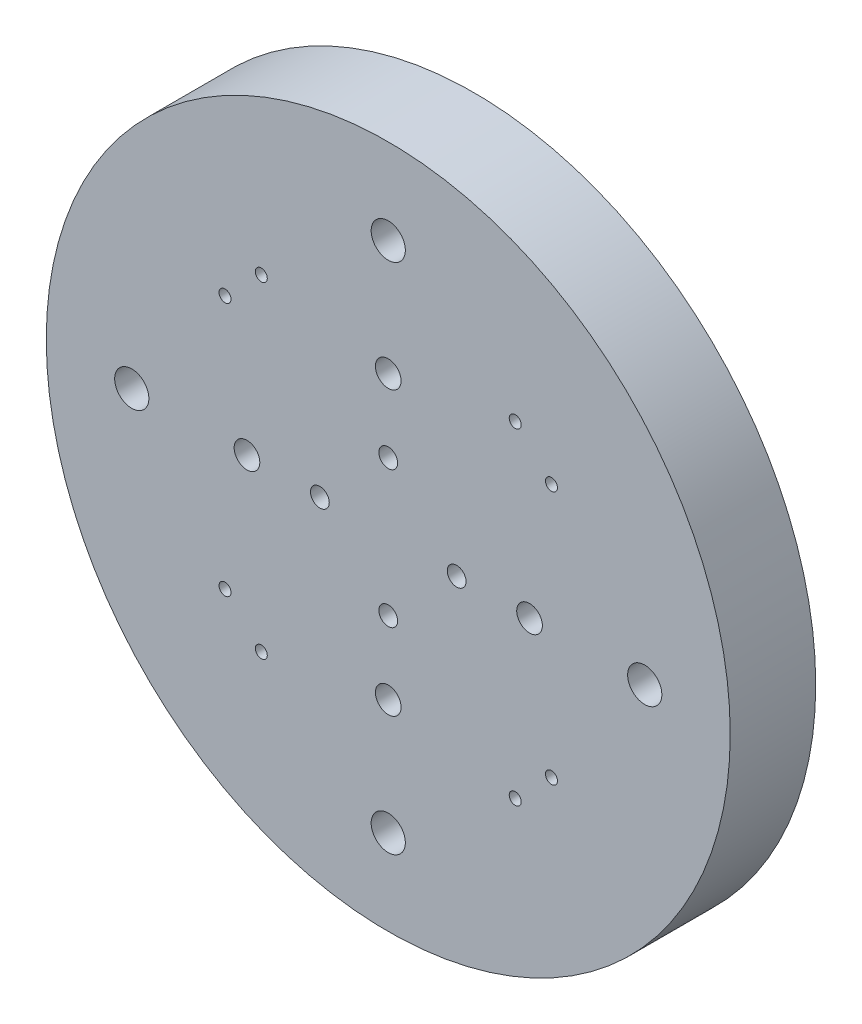
ISO-10303-21;
HEADER;
FILE_DESCRIPTION(('STEP AP214'),'2;1');
FILE_NAME('part.step','',(''),(''),'','','');
FILE_SCHEMA(('AUTOMOTIVE_DESIGN { 1 0 10303 214 1 1 1 1 }'));
ENDSEC;
DATA;
#1=APPLICATION_CONTEXT('core data for automotive mechanical design processes');
#2=APPLICATION_PROTOCOL_DEFINITION('international standard','automotive_design',2000,#1);
#3=PRODUCT_CONTEXT('',#1,'mechanical');
#4=PRODUCT('Part','Part','',(#3));
#5=PRODUCT_RELATED_PRODUCT_CATEGORY('part','',(#4));
#6=PRODUCT_DEFINITION_FORMATION('','',#4);
#7=PRODUCT_DEFINITION_CONTEXT('part definition',#1,'design');
#8=PRODUCT_DEFINITION('design','',#6,#7);
#9=PRODUCT_DEFINITION_SHAPE('','',#8);
#10=(LENGTH_UNIT() NAMED_UNIT(*) SI_UNIT(.MILLI.,.METRE.));
#11=(NAMED_UNIT(*) PLANE_ANGLE_UNIT() SI_UNIT($,.RADIAN.));
#12=(NAMED_UNIT(*) SI_UNIT($,.STERADIAN.) SOLID_ANGLE_UNIT());
#13=UNCERTAINTY_MEASURE_WITH_UNIT(LENGTH_MEASURE(1.E-05),#10,'distance_accuracy_value','');
#14=(GEOMETRIC_REPRESENTATION_CONTEXT(3) GLOBAL_UNCERTAINTY_ASSIGNED_CONTEXT((#13)) GLOBAL_UNIT_ASSIGNED_CONTEXT((#10,
#11,#12)) REPRESENTATION_CONTEXT('',''));
#15=CARTESIAN_POINT('',(0.,0.,0.));
#16=DIRECTION('',(0.,0.,1.));
#17=DIRECTION('',(1.,0.,0.));
#18=AXIS2_PLACEMENT_3D('',#15,#16,#17);
#19=CARTESIAN_POINT('',(0.,0.,10.));
#20=DIRECTION('',(0.,0.,-1.));
#21=DIRECTION('',(-1.,0.,0.));
#22=AXIS2_PLACEMENT_3D('',#19,#20,#21);
#23=CYLINDRICAL_SURFACE('',#22,40.);
#24=CARTESIAN_POINT('',(0.,0.,10.));
#25=DIRECTION('',(0.,0.,1.));
#26=DIRECTION('',(1.,0.,0.));
#27=AXIS2_PLACEMENT_3D('',#24,#25,#26);
#28=CIRCLE('',#27,40.);
#29=CARTESIAN_POINT('',(40.,0.,10.));
#30=VERTEX_POINT('',#29);
#31=EDGE_CURVE('E10',#30,#30,#28,.T.);
#32=ORIENTED_EDGE('',*,*,#31,.F.);
#33=EDGE_LOOP('',(#32));
#34=FACE_BOUND('',#33,.T.);
#35=CARTESIAN_POINT('',(0.,0.,0.));
#36=DIRECTION('',(0.,0.,1.));
#37=DIRECTION('',(1.,0.,0.));
#38=AXIS2_PLACEMENT_3D('',#35,#36,#37);
#39=CIRCLE('',#38,40.);
#40=CARTESIAN_POINT('',(40.,0.,0.));
#41=VERTEX_POINT('',#40);
#42=EDGE_CURVE('E34',#41,#41,#39,.T.);
#43=ORIENTED_EDGE('',*,*,#42,.T.);
#44=EDGE_LOOP('',(#43));
#45=FACE_BOUND('',#44,.T.);
#46=ADVANCED_FACE('F31',(#34,#45),#23,.T.);
#47=CARTESIAN_POINT('',(0.,0.,10.));
#48=DIRECTION('',(0.,0.,1.));
#49=DIRECTION('',(1.,0.,0.));
#50=AXIS2_PLACEMENT_3D('',#47,#48,#49);
#51=PLANE('',#50);
#52=CARTESIAN_POINT('',(-19.0918830920369,14.8492424049173,10.));
#53=DIRECTION('',(0.,0.,1.));
#54=DIRECTION('',(1.,0.,0.));
#55=AXIS2_PLACEMENT_3D('',#52,#53,#54);
#56=CIRCLE('',#55,0.699999999999999);
#57=CARTESIAN_POINT('',(-18.3918830920369,14.8492424049173,10.));
#58=VERTEX_POINT('',#57);
#59=EDGE_CURVE('E159',#58,#58,#56,.T.);
#60=ORIENTED_EDGE('',*,*,#59,.F.);
#61=EDGE_LOOP('',(#60));
#62=FACE_BOUND('',#61,.T.);
#63=CARTESIAN_POINT('',(-14.8492424049177,19.0918830920366,10.));
#64=DIRECTION('',(0.,0.,1.));
#65=DIRECTION('',(1.,0.,0.));
#66=AXIS2_PLACEMENT_3D('',#63,#64,#65);
#67=CIRCLE('',#66,0.699999999999999);
#68=CARTESIAN_POINT('',(-14.1492424049177,19.0918830920366,10.));
#69=VERTEX_POINT('',#68);
#70=EDGE_CURVE('E153',#69,#69,#67,.T.);
#71=ORIENTED_EDGE('',*,*,#70,.F.);
#72=EDGE_LOOP('',(#71));
#73=FACE_BOUND('',#72,.T.);
#74=CARTESIAN_POINT('',(14.8492424049175,19.0918830920368,10.));
#75=DIRECTION('',(0.,0.,1.));
#76=DIRECTION('',(1.,0.,0.));
#77=AXIS2_PLACEMENT_3D('',#74,#75,#76);
#78=CIRCLE('',#77,0.699999999999999);
#79=CARTESIAN_POINT('',(15.5492424049175,19.0918830920368,10.));
#80=VERTEX_POINT('',#79);
#81=EDGE_CURVE('E147',#80,#80,#78,.T.);
#82=ORIENTED_EDGE('',*,*,#81,.F.);
#83=EDGE_LOOP('',(#82));
#84=FACE_BOUND('',#83,.T.);
#85=CARTESIAN_POINT('',(19.0918830920368,14.8492424049175,10.));
#86=DIRECTION('',(0.,0.,1.));
#87=DIRECTION('',(1.,0.,0.));
#88=AXIS2_PLACEMENT_3D('',#85,#86,#87);
#89=CIRCLE('',#88,0.699999999999999);
#90=CARTESIAN_POINT('',(19.7918830920368,14.8492424049175,10.));
#91=VERTEX_POINT('',#90);
#92=EDGE_CURVE('E141',#91,#91,#89,.T.);
#93=ORIENTED_EDGE('',*,*,#92,.F.);
#94=EDGE_LOOP('',(#93));
#95=FACE_BOUND('',#94,.T.);
#96=CARTESIAN_POINT('',(19.0918830920368,-14.8492424049174,10.));
#97=DIRECTION('',(0.,0.,1.));
#98=DIRECTION('',(1.,0.,0.));
#99=AXIS2_PLACEMENT_3D('',#96,#97,#98);
#100=CIRCLE('',#99,0.699999999999999);
#101=CARTESIAN_POINT('',(19.7918830920368,-14.8492424049174,10.));
#102=VERTEX_POINT('',#101);
#103=EDGE_CURVE('E135',#102,#102,#100,.T.);
#104=ORIENTED_EDGE('',*,*,#103,.F.);
#105=EDGE_LOOP('',(#104));
#106=FACE_BOUND('',#105,.T.);
#107=CARTESIAN_POINT('',(14.8492424049176,-19.0918830920367,10.));
#108=DIRECTION('',(0.,0.,1.));
#109=DIRECTION('',(1.,0.,0.));
#110=AXIS2_PLACEMENT_3D('',#107,#108,#109);
#111=CIRCLE('',#110,0.699999999999999);
#112=CARTESIAN_POINT('',(15.5492424049176,-19.0918830920367,10.));
#113=VERTEX_POINT('',#112);
#114=EDGE_CURVE('E129',#113,#113,#111,.T.);
#115=ORIENTED_EDGE('',*,*,#114,.F.);
#116=EDGE_LOOP('',(#115));
#117=FACE_BOUND('',#116,.T.);
#118=CARTESIAN_POINT('',(-14.8492424049175,-19.0918830920368,10.));
#119=DIRECTION('',(0.,0.,1.));
#120=DIRECTION('',(1.,0.,0.));
#121=AXIS2_PLACEMENT_3D('',#118,#119,#120);
#122=CIRCLE('',#121,0.699999999999999);
#123=CARTESIAN_POINT('',(-14.1492424049175,-19.0918830920368,10.));
#124=VERTEX_POINT('',#123);
#125=EDGE_CURVE('E123',#124,#124,#122,.T.);
#126=ORIENTED_EDGE('',*,*,#125,.F.);
#127=EDGE_LOOP('',(#126));
#128=FACE_BOUND('',#127,.T.);
#129=CARTESIAN_POINT('',(-19.0918830920368,-14.8492424049175,10.));
#130=DIRECTION('',(0.,0.,1.));
#131=DIRECTION('',(1.,0.,0.));
#132=AXIS2_PLACEMENT_3D('',#129,#130,#131);
#133=CIRCLE('',#132,0.699999999999999);
#134=CARTESIAN_POINT('',(-18.3918830920368,-14.8492424049175,10.));
#135=VERTEX_POINT('',#134);
#136=EDGE_CURVE('E117',#135,#135,#133,.T.);
#137=ORIENTED_EDGE('',*,*,#136,.F.);
#138=EDGE_LOOP('',(#137));
#139=FACE_BOUND('',#138,.T.);
#140=CARTESIAN_POINT('',(0.,-16.524479989549,10.));
#141=DIRECTION('',(0.,0.,1.));
#142=DIRECTION('',(1.,0.,0.));
#143=AXIS2_PLACEMENT_3D('',#140,#141,#142);
#144=CIRCLE('',#143,1.5);
#145=CARTESIAN_POINT('',(1.5,-16.524479989549,10.));
#146=VERTEX_POINT('',#145);
#147=EDGE_CURVE('E111',#146,#146,#144,.T.);
#148=ORIENTED_EDGE('',*,*,#147,.F.);
#149=EDGE_LOOP('',(#148));
#150=FACE_BOUND('',#149,.T.);
#151=CARTESIAN_POINT('',(16.524479989549,0.,10.));
#152=DIRECTION('',(0.,0.,1.));
#153=DIRECTION('',(1.,0.,0.));
#154=AXIS2_PLACEMENT_3D('',#151,#152,#153);
#155=CIRCLE('',#154,1.5);
#156=CARTESIAN_POINT('',(18.024479989549,0.,10.));
#157=VERTEX_POINT('',#156);
#158=EDGE_CURVE('E105',#157,#157,#155,.T.);
#159=ORIENTED_EDGE('',*,*,#158,.F.);
#160=EDGE_LOOP('',(#159));
#161=FACE_BOUND('',#160,.T.);
#162=CARTESIAN_POINT('',(0.,16.524479989549,10.));
#163=DIRECTION('',(0.,0.,1.));
#164=DIRECTION('',(1.,0.,0.));
#165=AXIS2_PLACEMENT_3D('',#162,#163,#164);
#166=CIRCLE('',#165,1.5);
#167=CARTESIAN_POINT('',(1.5,16.524479989549,10.));
#168=VERTEX_POINT('',#167);
#169=EDGE_CURVE('E99',#168,#168,#166,.T.);
#170=ORIENTED_EDGE('',*,*,#169,.F.);
#171=EDGE_LOOP('',(#170));
#172=FACE_BOUND('',#171,.T.);
#173=CARTESIAN_POINT('',(-16.524479989549,0.,10.));
#174=DIRECTION('',(0.,0.,1.));
#175=DIRECTION('',(1.,0.,0.));
#176=AXIS2_PLACEMENT_3D('',#173,#174,#175);
#177=CIRCLE('',#176,1.5);
#178=CARTESIAN_POINT('',(-15.024479989549,0.,10.));
#179=VERTEX_POINT('',#178);
#180=EDGE_CURVE('E93',#179,#179,#177,.T.);
#181=ORIENTED_EDGE('',*,*,#180,.F.);
#182=EDGE_LOOP('',(#181));
#183=FACE_BOUND('',#182,.T.);
#184=CARTESIAN_POINT('',(0.,8.,10.));
#185=DIRECTION('',(0.,0.,1.));
#186=DIRECTION('',(1.,0.,0.));
#187=AXIS2_PLACEMENT_3D('',#184,#185,#186);
#188=CIRCLE('',#187,1.1);
#189=CARTESIAN_POINT('',(1.1,8.,10.));
#190=VERTEX_POINT('',#189);
#191=EDGE_CURVE('E87',#190,#190,#188,.T.);
#192=ORIENTED_EDGE('',*,*,#191,.F.);
#193=EDGE_LOOP('',(#192));
#194=FACE_BOUND('',#193,.T.);
#195=CARTESIAN_POINT('',(0.,-8.,10.));
#196=DIRECTION('',(0.,0.,1.));
#197=DIRECTION('',(1.,0.,0.));
#198=AXIS2_PLACEMENT_3D('',#195,#196,#197);
#199=CIRCLE('',#198,1.1);
#200=CARTESIAN_POINT('',(1.1,-8.,10.));
#201=VERTEX_POINT('',#200);
#202=EDGE_CURVE('E81',#201,#201,#199,.T.);
#203=ORIENTED_EDGE('',*,*,#202,.F.);
#204=EDGE_LOOP('',(#203));
#205=FACE_BOUND('',#204,.T.);
#206=CARTESIAN_POINT('',(-8.,0.,10.));
#207=DIRECTION('',(0.,0.,1.));
#208=DIRECTION('',(1.,0.,0.));
#209=AXIS2_PLACEMENT_3D('',#206,#207,#208);
#210=CIRCLE('',#209,1.1);
#211=CARTESIAN_POINT('',(-6.9,0.,10.));
#212=VERTEX_POINT('',#211);
#213=EDGE_CURVE('E75',#212,#212,#210,.T.);
#214=ORIENTED_EDGE('',*,*,#213,.F.);
#215=EDGE_LOOP('',(#214));
#216=FACE_BOUND('',#215,.T.);
#217=CARTESIAN_POINT('',(8.,0.,10.));
#218=DIRECTION('',(0.,0.,1.));
#219=DIRECTION('',(1.,0.,0.));
#220=AXIS2_PLACEMENT_3D('',#217,#218,#219);
#221=CIRCLE('',#220,1.1);
#222=CARTESIAN_POINT('',(9.1,0.,10.));
#223=VERTEX_POINT('',#222);
#224=EDGE_CURVE('E69',#223,#223,#221,.T.);
#225=ORIENTED_EDGE('',*,*,#224,.F.);
#226=EDGE_LOOP('',(#225));
#227=FACE_BOUND('',#226,.T.);
#228=CARTESIAN_POINT('',(0.,30.,10.));
#229=DIRECTION('',(0.,0.,1.));
#230=DIRECTION('',(1.,0.,0.));
#231=AXIS2_PLACEMENT_3D('',#228,#229,#230);
#232=CIRCLE('',#231,2.);
#233=CARTESIAN_POINT('',(2.,30.,10.));
#234=VERTEX_POINT('',#233);
#235=EDGE_CURVE('E63',#234,#234,#232,.T.);
#236=ORIENTED_EDGE('',*,*,#235,.F.);
#237=EDGE_LOOP('',(#236));
#238=FACE_BOUND('',#237,.T.);
#239=CARTESIAN_POINT('',(30.,0.,10.));
#240=DIRECTION('',(0.,0.,1.));
#241=DIRECTION('',(1.,0.,0.));
#242=AXIS2_PLACEMENT_3D('',#239,#240,#241);
#243=CIRCLE('',#242,2.);
#244=CARTESIAN_POINT('',(32.,0.,10.));
#245=VERTEX_POINT('',#244);
#246=EDGE_CURVE('E57',#245,#245,#243,.T.);
#247=ORIENTED_EDGE('',*,*,#246,.F.);
#248=EDGE_LOOP('',(#247));
#249=FACE_BOUND('',#248,.T.);
#250=CARTESIAN_POINT('',(-30.,0.,10.));
#251=DIRECTION('',(0.,0.,1.));
#252=DIRECTION('',(1.,0.,0.));
#253=AXIS2_PLACEMENT_3D('',#250,#251,#252);
#254=CIRCLE('',#253,2.);
#255=CARTESIAN_POINT('',(-28.,0.,10.));
#256=VERTEX_POINT('',#255);
#257=EDGE_CURVE('E51',#256,#256,#254,.T.);
#258=ORIENTED_EDGE('',*,*,#257,.F.);
#259=EDGE_LOOP('',(#258));
#260=FACE_BOUND('',#259,.T.);
#261=CARTESIAN_POINT('',(0.,-30.,10.));
#262=DIRECTION('',(0.,0.,1.));
#263=DIRECTION('',(1.,0.,0.));
#264=AXIS2_PLACEMENT_3D('',#261,#262,#263);
#265=CIRCLE('',#264,2.);
#266=CARTESIAN_POINT('',(2.,-30.,10.));
#267=VERTEX_POINT('',#266);
#268=EDGE_CURVE('E45',#267,#267,#265,.T.);
#269=ORIENTED_EDGE('',*,*,#268,.F.);
#270=EDGE_LOOP('',(#269));
#271=FACE_BOUND('',#270,.T.);
#272=ORIENTED_EDGE('',*,*,#31,.T.);
#273=EDGE_LOOP('',(#272));
#274=FACE_BOUND('',#273,.T.);
#275=ADVANCED_FACE('F165',(#62,#73,#84,#95,#106,#117,#128,#139,#150,#161,#172,#183,#194,#205,
#216,#227,#238,#249,#260,#271,#274),#51,.T.);
#276=CARTESIAN_POINT('',(0.,0.,0.));
#277=DIRECTION('',(0.,0.,1.));
#278=DIRECTION('',(1.,0.,0.));
#279=AXIS2_PLACEMENT_3D('',#276,#277,#278);
#280=PLANE('',#279);
#281=CARTESIAN_POINT('',(-19.0918830920369,14.8492424049173,0.));
#282=DIRECTION('',(0.,0.,1.));
#283=DIRECTION('',(1.,0.,0.));
#284=AXIS2_PLACEMENT_3D('',#281,#282,#283);
#285=CIRCLE('',#284,0.699999999999996);
#286=CARTESIAN_POINT('',(-18.3918830920369,14.8492424049173,0.));
#287=VERTEX_POINT('',#286);
#288=EDGE_CURVE('E156',#287,#287,#285,.T.);
#289=ORIENTED_EDGE('',*,*,#288,.T.);
#290=EDGE_LOOP('',(#289));
#291=FACE_BOUND('',#290,.T.);
#292=CARTESIAN_POINT('',(-14.8492424049177,19.0918830920366,0.));
#293=DIRECTION('',(0.,0.,1.));
#294=DIRECTION('',(1.,0.,0.));
#295=AXIS2_PLACEMENT_3D('',#292,#293,#294);
#296=CIRCLE('',#295,0.699999999999998);
#297=CARTESIAN_POINT('',(-14.1492424049177,19.0918830920366,0.));
#298=VERTEX_POINT('',#297);
#299=EDGE_CURVE('E150',#298,#298,#296,.T.);
#300=ORIENTED_EDGE('',*,*,#299,.T.);
#301=EDGE_LOOP('',(#300));
#302=FACE_BOUND('',#301,.T.);
#303=CARTESIAN_POINT('',(14.8492424049175,19.0918830920368,0.));
#304=DIRECTION('',(0.,0.,1.));
#305=DIRECTION('',(1.,0.,0.));
#306=AXIS2_PLACEMENT_3D('',#303,#304,#305);
#307=CIRCLE('',#306,0.699999999999998);
#308=CARTESIAN_POINT('',(15.5492424049175,19.0918830920368,0.));
#309=VERTEX_POINT('',#308);
#310=EDGE_CURVE('E144',#309,#309,#307,.T.);
#311=ORIENTED_EDGE('',*,*,#310,.T.);
#312=EDGE_LOOP('',(#311));
#313=FACE_BOUND('',#312,.T.);
#314=CARTESIAN_POINT('',(19.0918830920368,14.8492424049175,0.));
#315=DIRECTION('',(0.,0.,1.));
#316=DIRECTION('',(1.,0.,0.));
#317=AXIS2_PLACEMENT_3D('',#314,#315,#316);
#318=CIRCLE('',#317,0.699999999999999);
#319=CARTESIAN_POINT('',(19.7918830920368,14.8492424049175,0.));
#320=VERTEX_POINT('',#319);
#321=EDGE_CURVE('E138',#320,#320,#318,.T.);
#322=ORIENTED_EDGE('',*,*,#321,.T.);
#323=EDGE_LOOP('',(#322));
#324=FACE_BOUND('',#323,.T.);
#325=CARTESIAN_POINT('',(19.0918830920368,-14.8492424049174,0.));
#326=DIRECTION('',(0.,0.,1.));
#327=DIRECTION('',(1.,0.,0.));
#328=AXIS2_PLACEMENT_3D('',#325,#326,#327);
#329=CIRCLE('',#328,0.699999999999996);
#330=CARTESIAN_POINT('',(19.7918830920368,-14.8492424049174,0.));
#331=VERTEX_POINT('',#330);
#332=EDGE_CURVE('E132',#331,#331,#329,.T.);
#333=ORIENTED_EDGE('',*,*,#332,.T.);
#334=EDGE_LOOP('',(#333));
#335=FACE_BOUND('',#334,.T.);
#336=CARTESIAN_POINT('',(14.8492424049176,-19.0918830920367,0.));
#337=DIRECTION('',(0.,0.,1.));
#338=DIRECTION('',(1.,0.,0.));
#339=AXIS2_PLACEMENT_3D('',#336,#337,#338);
#340=CIRCLE('',#339,0.699999999999998);
#341=CARTESIAN_POINT('',(15.5492424049176,-19.0918830920367,0.));
#342=VERTEX_POINT('',#341);
#343=EDGE_CURVE('E126',#342,#342,#340,.T.);
#344=ORIENTED_EDGE('',*,*,#343,.T.);
#345=EDGE_LOOP('',(#344));
#346=FACE_BOUND('',#345,.T.);
#347=CARTESIAN_POINT('',(-14.8492424049175,-19.0918830920368,0.));
#348=DIRECTION('',(0.,0.,1.));
#349=DIRECTION('',(1.,0.,0.));
#350=AXIS2_PLACEMENT_3D('',#347,#348,#349);
#351=CIRCLE('',#350,0.699999999999998);
#352=CARTESIAN_POINT('',(-14.1492424049175,-19.0918830920368,0.));
#353=VERTEX_POINT('',#352);
#354=EDGE_CURVE('E120',#353,#353,#351,.T.);
#355=ORIENTED_EDGE('',*,*,#354,.T.);
#356=EDGE_LOOP('',(#355));
#357=FACE_BOUND('',#356,.T.);
#358=CARTESIAN_POINT('',(-19.0918830920368,-14.8492424049175,0.));
#359=DIRECTION('',(0.,0.,1.));
#360=DIRECTION('',(1.,0.,0.));
#361=AXIS2_PLACEMENT_3D('',#358,#359,#360);
#362=CIRCLE('',#361,0.699999999999999);
#363=CARTESIAN_POINT('',(-18.3918830920368,-14.8492424049175,0.));
#364=VERTEX_POINT('',#363);
#365=EDGE_CURVE('E114',#364,#364,#362,.T.);
#366=ORIENTED_EDGE('',*,*,#365,.T.);
#367=EDGE_LOOP('',(#366));
#368=FACE_BOUND('',#367,.T.);
#369=CARTESIAN_POINT('',(0.,-16.524479989549,0.));
#370=DIRECTION('',(0.,0.,1.));
#371=DIRECTION('',(1.,0.,0.));
#372=AXIS2_PLACEMENT_3D('',#369,#370,#371);
#373=CIRCLE('',#372,1.5);
#374=CARTESIAN_POINT('',(1.5,-16.524479989549,0.));
#375=VERTEX_POINT('',#374);
#376=EDGE_CURVE('E108',#375,#375,#373,.T.);
#377=ORIENTED_EDGE('',*,*,#376,.T.);
#378=EDGE_LOOP('',(#377));
#379=FACE_BOUND('',#378,.T.);
#380=CARTESIAN_POINT('',(16.524479989549,0.,0.));
#381=DIRECTION('',(0.,0.,1.));
#382=DIRECTION('',(1.,0.,0.));
#383=AXIS2_PLACEMENT_3D('',#380,#381,#382);
#384=CIRCLE('',#383,1.5);
#385=CARTESIAN_POINT('',(18.024479989549,0.,0.));
#386=VERTEX_POINT('',#385);
#387=EDGE_CURVE('E102',#386,#386,#384,.T.);
#388=ORIENTED_EDGE('',*,*,#387,.T.);
#389=EDGE_LOOP('',(#388));
#390=FACE_BOUND('',#389,.T.);
#391=CARTESIAN_POINT('',(0.,16.524479989549,0.));
#392=DIRECTION('',(0.,0.,1.));
#393=DIRECTION('',(1.,0.,0.));
#394=AXIS2_PLACEMENT_3D('',#391,#392,#393);
#395=CIRCLE('',#394,1.5);
#396=CARTESIAN_POINT('',(1.5,16.524479989549,0.));
#397=VERTEX_POINT('',#396);
#398=EDGE_CURVE('E96',#397,#397,#395,.T.);
#399=ORIENTED_EDGE('',*,*,#398,.T.);
#400=EDGE_LOOP('',(#399));
#401=FACE_BOUND('',#400,.T.);
#402=CARTESIAN_POINT('',(-16.524479989549,0.,0.));
#403=DIRECTION('',(0.,0.,1.));
#404=DIRECTION('',(1.,0.,0.));
#405=AXIS2_PLACEMENT_3D('',#402,#403,#404);
#406=CIRCLE('',#405,1.5);
#407=CARTESIAN_POINT('',(-15.024479989549,0.,0.));
#408=VERTEX_POINT('',#407);
#409=EDGE_CURVE('E90',#408,#408,#406,.T.);
#410=ORIENTED_EDGE('',*,*,#409,.T.);
#411=EDGE_LOOP('',(#410));
#412=FACE_BOUND('',#411,.T.);
#413=CARTESIAN_POINT('',(0.,8.,0.));
#414=DIRECTION('',(0.,0.,1.));
#415=DIRECTION('',(1.,0.,0.));
#416=AXIS2_PLACEMENT_3D('',#413,#414,#415);
#417=CIRCLE('',#416,1.1);
#418=CARTESIAN_POINT('',(1.1,8.,0.));
#419=VERTEX_POINT('',#418);
#420=EDGE_CURVE('E84',#419,#419,#417,.T.);
#421=ORIENTED_EDGE('',*,*,#420,.T.);
#422=EDGE_LOOP('',(#421));
#423=FACE_BOUND('',#422,.T.);
#424=CARTESIAN_POINT('',(0.,-8.,0.));
#425=DIRECTION('',(0.,0.,1.));
#426=DIRECTION('',(1.,0.,0.));
#427=AXIS2_PLACEMENT_3D('',#424,#425,#426);
#428=CIRCLE('',#427,1.1);
#429=CARTESIAN_POINT('',(1.1,-8.,0.));
#430=VERTEX_POINT('',#429);
#431=EDGE_CURVE('E78',#430,#430,#428,.T.);
#432=ORIENTED_EDGE('',*,*,#431,.T.);
#433=EDGE_LOOP('',(#432));
#434=FACE_BOUND('',#433,.T.);
#435=CARTESIAN_POINT('',(-8.,0.,0.));
#436=DIRECTION('',(0.,0.,1.));
#437=DIRECTION('',(1.,0.,0.));
#438=AXIS2_PLACEMENT_3D('',#435,#436,#437);
#439=CIRCLE('',#438,1.1);
#440=CARTESIAN_POINT('',(-6.9,0.,0.));
#441=VERTEX_POINT('',#440);
#442=EDGE_CURVE('E72',#441,#441,#439,.T.);
#443=ORIENTED_EDGE('',*,*,#442,.T.);
#444=EDGE_LOOP('',(#443));
#445=FACE_BOUND('',#444,.T.);
#446=CARTESIAN_POINT('',(8.,0.,0.));
#447=DIRECTION('',(0.,0.,1.));
#448=DIRECTION('',(1.,0.,0.));
#449=AXIS2_PLACEMENT_3D('',#446,#447,#448);
#450=CIRCLE('',#449,1.1);
#451=CARTESIAN_POINT('',(9.1,0.,0.));
#452=VERTEX_POINT('',#451);
#453=EDGE_CURVE('E66',#452,#452,#450,.T.);
#454=ORIENTED_EDGE('',*,*,#453,.T.);
#455=EDGE_LOOP('',(#454));
#456=FACE_BOUND('',#455,.T.);
#457=CARTESIAN_POINT('',(0.,30.,0.));
#458=DIRECTION('',(0.,0.,1.));
#459=DIRECTION('',(1.,0.,0.));
#460=AXIS2_PLACEMENT_3D('',#457,#458,#459);
#461=CIRCLE('',#460,2.);
#462=CARTESIAN_POINT('',(2.,30.,0.));
#463=VERTEX_POINT('',#462);
#464=EDGE_CURVE('E60',#463,#463,#461,.T.);
#465=ORIENTED_EDGE('',*,*,#464,.T.);
#466=EDGE_LOOP('',(#465));
#467=FACE_BOUND('',#466,.T.);
#468=CARTESIAN_POINT('',(30.,0.,0.));
#469=DIRECTION('',(0.,0.,1.));
#470=DIRECTION('',(1.,0.,0.));
#471=AXIS2_PLACEMENT_3D('',#468,#469,#470);
#472=CIRCLE('',#471,1.99999999999999);
#473=CARTESIAN_POINT('',(32.,0.,0.));
#474=VERTEX_POINT('',#473);
#475=EDGE_CURVE('E54',#474,#474,#472,.T.);
#476=ORIENTED_EDGE('',*,*,#475,.T.);
#477=EDGE_LOOP('',(#476));
#478=FACE_BOUND('',#477,.T.);
#479=CARTESIAN_POINT('',(-30.,0.,0.));
#480=DIRECTION('',(0.,0.,1.));
#481=DIRECTION('',(1.,0.,0.));
#482=AXIS2_PLACEMENT_3D('',#479,#480,#481);
#483=CIRCLE('',#482,2.);
#484=CARTESIAN_POINT('',(-28.,0.,0.));
#485=VERTEX_POINT('',#484);
#486=EDGE_CURVE('E48',#485,#485,#483,.T.);
#487=ORIENTED_EDGE('',*,*,#486,.T.);
#488=EDGE_LOOP('',(#487));
#489=FACE_BOUND('',#488,.T.);
#490=CARTESIAN_POINT('',(0.,-30.,0.));
#491=DIRECTION('',(0.,0.,1.));
#492=DIRECTION('',(1.,0.,0.));
#493=AXIS2_PLACEMENT_3D('',#490,#491,#492);
#494=CIRCLE('',#493,2.);
#495=CARTESIAN_POINT('',(2.,-30.,0.));
#496=VERTEX_POINT('',#495);
#497=EDGE_CURVE('E41',#496,#496,#494,.T.);
#498=ORIENTED_EDGE('',*,*,#497,.T.);
#499=EDGE_LOOP('',(#498));
#500=FACE_BOUND('',#499,.T.);
#501=ORIENTED_EDGE('',*,*,#42,.F.);
#502=EDGE_LOOP('',(#501));
#503=FACE_BOUND('',#502,.T.);
#504=ADVANCED_FACE('F168',(#291,#302,#313,#324,#335,#346,#357,#368,#379,#390,#401,#412,#423,
#434,#445,#456,#467,#478,#489,#500,#503),#280,.F.);
#505=CARTESIAN_POINT('',(0.,-30.,10.));
#506=DIRECTION('',(0.,0.,1.));
#507=DIRECTION('',(1.,0.,0.));
#508=AXIS2_PLACEMENT_3D('',#505,#506,#507);
#509=CYLINDRICAL_SURFACE('',#508,2.);
#510=ORIENTED_EDGE('',*,*,#497,.F.);
#511=EDGE_LOOP('',(#510));
#512=FACE_BOUND('',#511,.T.);
#513=ORIENTED_EDGE('',*,*,#268,.T.);
#514=EDGE_LOOP('',(#513));
#515=FACE_BOUND('',#514,.T.);
#516=ADVANCED_FACE('F208',(#512,#515),#509,.F.);
#517=CARTESIAN_POINT('',(-30.,0.,10.));
#518=DIRECTION('',(0.,0.,1.));
#519=DIRECTION('',(1.,0.,0.));
#520=AXIS2_PLACEMENT_3D('',#517,#518,#519);
#521=CYLINDRICAL_SURFACE('',#520,2.);
#522=ORIENTED_EDGE('',*,*,#486,.F.);
#523=EDGE_LOOP('',(#522));
#524=FACE_BOUND('',#523,.T.);
#525=ORIENTED_EDGE('',*,*,#257,.T.);
#526=EDGE_LOOP('',(#525));
#527=FACE_BOUND('',#526,.T.);
#528=ADVANCED_FACE('F210',(#524,#527),#521,.F.);
#529=CARTESIAN_POINT('',(30.,0.,10.));
#530=DIRECTION('',(0.,0.,1.));
#531=DIRECTION('',(1.,0.,0.));
#532=AXIS2_PLACEMENT_3D('',#529,#530,#531);
#533=CYLINDRICAL_SURFACE('',#532,2.);
#534=ORIENTED_EDGE('',*,*,#475,.F.);
#535=EDGE_LOOP('',(#534));
#536=FACE_BOUND('',#535,.T.);
#537=ORIENTED_EDGE('',*,*,#246,.T.);
#538=EDGE_LOOP('',(#537));
#539=FACE_BOUND('',#538,.T.);
#540=ADVANCED_FACE('F217',(#536,#539),#533,.F.);
#541=CARTESIAN_POINT('',(0.,30.,10.));
#542=DIRECTION('',(0.,0.,1.));
#543=DIRECTION('',(1.,0.,0.));
#544=AXIS2_PLACEMENT_3D('',#541,#542,#543);
#545=CYLINDRICAL_SURFACE('',#544,2.);
#546=ORIENTED_EDGE('',*,*,#464,.F.);
#547=EDGE_LOOP('',(#546));
#548=FACE_BOUND('',#547,.T.);
#549=ORIENTED_EDGE('',*,*,#235,.T.);
#550=EDGE_LOOP('',(#549));
#551=FACE_BOUND('',#550,.T.);
#552=ADVANCED_FACE('F344',(#548,#551),#545,.F.);
#553=CARTESIAN_POINT('',(8.,0.,10.));
#554=DIRECTION('',(0.,0.,1.));
#555=DIRECTION('',(1.,0.,0.));
#556=AXIS2_PLACEMENT_3D('',#553,#554,#555);
#557=CYLINDRICAL_SURFACE('',#556,1.1);
#558=ORIENTED_EDGE('',*,*,#453,.F.);
#559=EDGE_LOOP('',(#558));
#560=FACE_BOUND('',#559,.T.);
#561=ORIENTED_EDGE('',*,*,#224,.T.);
#562=EDGE_LOOP('',(#561));
#563=FACE_BOUND('',#562,.T.);
#564=ADVANCED_FACE('F340',(#560,#563),#557,.F.);
#565=CARTESIAN_POINT('',(-8.,0.,10.));
#566=DIRECTION('',(0.,0.,1.));
#567=DIRECTION('',(1.,0.,0.));
#568=AXIS2_PLACEMENT_3D('',#565,#566,#567);
#569=CYLINDRICAL_SURFACE('',#568,1.1);
#570=ORIENTED_EDGE('',*,*,#442,.F.);
#571=EDGE_LOOP('',(#570));
#572=FACE_BOUND('',#571,.T.);
#573=ORIENTED_EDGE('',*,*,#213,.T.);
#574=EDGE_LOOP('',(#573));
#575=FACE_BOUND('',#574,.T.);
#576=ADVANCED_FACE('F336',(#572,#575),#569,.F.);
#577=CARTESIAN_POINT('',(0.,-8.,10.));
#578=DIRECTION('',(0.,0.,1.));
#579=DIRECTION('',(1.,0.,0.));
#580=AXIS2_PLACEMENT_3D('',#577,#578,#579);
#581=CYLINDRICAL_SURFACE('',#580,1.1);
#582=ORIENTED_EDGE('',*,*,#431,.F.);
#583=EDGE_LOOP('',(#582));
#584=FACE_BOUND('',#583,.T.);
#585=ORIENTED_EDGE('',*,*,#202,.T.);
#586=EDGE_LOOP('',(#585));
#587=FACE_BOUND('',#586,.T.);
#588=ADVANCED_FACE('F332',(#584,#587),#581,.F.);
#589=CARTESIAN_POINT('',(0.,8.,10.));
#590=DIRECTION('',(0.,0.,1.));
#591=DIRECTION('',(1.,0.,0.));
#592=AXIS2_PLACEMENT_3D('',#589,#590,#591);
#593=CYLINDRICAL_SURFACE('',#592,1.1);
#594=ORIENTED_EDGE('',*,*,#420,.F.);
#595=EDGE_LOOP('',(#594));
#596=FACE_BOUND('',#595,.T.);
#597=ORIENTED_EDGE('',*,*,#191,.T.);
#598=EDGE_LOOP('',(#597));
#599=FACE_BOUND('',#598,.T.);
#600=ADVANCED_FACE('F328',(#596,#599),#593,.F.);
#601=CARTESIAN_POINT('',(-16.524479989549,0.,10.));
#602=DIRECTION('',(0.,0.,1.));
#603=DIRECTION('',(1.,0.,0.));
#604=AXIS2_PLACEMENT_3D('',#601,#602,#603);
#605=CYLINDRICAL_SURFACE('',#604,1.5);
#606=ORIENTED_EDGE('',*,*,#409,.F.);
#607=EDGE_LOOP('',(#606));
#608=FACE_BOUND('',#607,.T.);
#609=ORIENTED_EDGE('',*,*,#180,.T.);
#610=EDGE_LOOP('',(#609));
#611=FACE_BOUND('',#610,.T.);
#612=ADVANCED_FACE('F324',(#608,#611),#605,.F.);
#613=CARTESIAN_POINT('',(0.,16.524479989549,10.));
#614=DIRECTION('',(0.,0.,1.));
#615=DIRECTION('',(1.,0.,0.));
#616=AXIS2_PLACEMENT_3D('',#613,#614,#615);
#617=CYLINDRICAL_SURFACE('',#616,1.5);
#618=ORIENTED_EDGE('',*,*,#398,.F.);
#619=EDGE_LOOP('',(#618));
#620=FACE_BOUND('',#619,.T.);
#621=ORIENTED_EDGE('',*,*,#169,.T.);
#622=EDGE_LOOP('',(#621));
#623=FACE_BOUND('',#622,.T.);
#624=ADVANCED_FACE('F320',(#620,#623),#617,.F.);
#625=CARTESIAN_POINT('',(16.524479989549,0.,10.));
#626=DIRECTION('',(0.,0.,1.));
#627=DIRECTION('',(1.,0.,0.));
#628=AXIS2_PLACEMENT_3D('',#625,#626,#627);
#629=CYLINDRICAL_SURFACE('',#628,1.5);
#630=ORIENTED_EDGE('',*,*,#387,.F.);
#631=EDGE_LOOP('',(#630));
#632=FACE_BOUND('',#631,.T.);
#633=ORIENTED_EDGE('',*,*,#158,.T.);
#634=EDGE_LOOP('',(#633));
#635=FACE_BOUND('',#634,.T.);
#636=ADVANCED_FACE('F316',(#632,#635),#629,.F.);
#637=CARTESIAN_POINT('',(0.,-16.524479989549,10.));
#638=DIRECTION('',(0.,0.,1.));
#639=DIRECTION('',(1.,0.,0.));
#640=AXIS2_PLACEMENT_3D('',#637,#638,#639);
#641=CYLINDRICAL_SURFACE('',#640,1.5);
#642=ORIENTED_EDGE('',*,*,#376,.F.);
#643=EDGE_LOOP('',(#642));
#644=FACE_BOUND('',#643,.T.);
#645=ORIENTED_EDGE('',*,*,#147,.T.);
#646=EDGE_LOOP('',(#645));
#647=FACE_BOUND('',#646,.T.);
#648=ADVANCED_FACE('F312',(#644,#647),#641,.F.);
#649=CARTESIAN_POINT('',(-19.0918830920368,-14.8492424049175,10.));
#650=DIRECTION('',(0.,0.,1.));
#651=DIRECTION('',(1.,0.,0.));
#652=AXIS2_PLACEMENT_3D('',#649,#650,#651);
#653=CYLINDRICAL_SURFACE('',#652,0.699999999999999);
#654=ORIENTED_EDGE('',*,*,#365,.F.);
#655=EDGE_LOOP('',(#654));
#656=FACE_BOUND('',#655,.T.);
#657=ORIENTED_EDGE('',*,*,#136,.T.);
#658=EDGE_LOOP('',(#657));
#659=FACE_BOUND('',#658,.T.);
#660=ADVANCED_FACE('F308',(#656,#659),#653,.F.);
#661=CARTESIAN_POINT('',(-14.8492424049175,-19.0918830920368,10.));
#662=DIRECTION('',(0.,0.,1.));
#663=DIRECTION('',(1.,0.,0.));
#664=AXIS2_PLACEMENT_3D('',#661,#662,#663);
#665=CYLINDRICAL_SURFACE('',#664,0.699999999999998);
#666=ORIENTED_EDGE('',*,*,#354,.F.);
#667=EDGE_LOOP('',(#666));
#668=FACE_BOUND('',#667,.T.);
#669=ORIENTED_EDGE('',*,*,#125,.T.);
#670=EDGE_LOOP('',(#669));
#671=FACE_BOUND('',#670,.T.);
#672=ADVANCED_FACE('F250',(#668,#671),#665,.F.);
#673=CARTESIAN_POINT('',(14.8492424049176,-19.0918830920367,10.));
#674=DIRECTION('',(0.,0.,1.));
#675=DIRECTION('',(1.,0.,0.));
#676=AXIS2_PLACEMENT_3D('',#673,#674,#675);
#677=CYLINDRICAL_SURFACE('',#676,0.699999999999998);
#678=ORIENTED_EDGE('',*,*,#343,.F.);
#679=EDGE_LOOP('',(#678));
#680=FACE_BOUND('',#679,.T.);
#681=ORIENTED_EDGE('',*,*,#114,.T.);
#682=EDGE_LOOP('',(#681));
#683=FACE_BOUND('',#682,.T.);
#684=ADVANCED_FACE('F244',(#680,#683),#677,.F.);
#685=CARTESIAN_POINT('',(19.0918830920368,-14.8492424049174,10.));
#686=DIRECTION('',(0.,0.,1.));
#687=DIRECTION('',(1.,0.,0.));
#688=AXIS2_PLACEMENT_3D('',#685,#686,#687);
#689=CYLINDRICAL_SURFACE('',#688,0.699999999999998);
#690=ORIENTED_EDGE('',*,*,#332,.F.);
#691=EDGE_LOOP('',(#690));
#692=FACE_BOUND('',#691,.T.);
#693=ORIENTED_EDGE('',*,*,#103,.T.);
#694=EDGE_LOOP('',(#693));
#695=FACE_BOUND('',#694,.T.);
#696=ADVANCED_FACE('F249',(#692,#695),#689,.F.);
#697=CARTESIAN_POINT('',(19.0918830920368,14.8492424049175,10.));
#698=DIRECTION('',(0.,0.,1.));
#699=DIRECTION('',(1.,0.,0.));
#700=AXIS2_PLACEMENT_3D('',#697,#698,#699);
#701=CYLINDRICAL_SURFACE('',#700,0.699999999999999);
#702=ORIENTED_EDGE('',*,*,#321,.F.);
#703=EDGE_LOOP('',(#702));
#704=FACE_BOUND('',#703,.T.);
#705=ORIENTED_EDGE('',*,*,#92,.T.);
#706=EDGE_LOOP('',(#705));
#707=FACE_BOUND('',#706,.T.);
#708=ADVANCED_FACE('F262',(#704,#707),#701,.F.);
#709=CARTESIAN_POINT('',(14.8492424049175,19.0918830920368,10.));
#710=DIRECTION('',(0.,0.,1.));
#711=DIRECTION('',(1.,0.,0.));
#712=AXIS2_PLACEMENT_3D('',#709,#710,#711);
#713=CYLINDRICAL_SURFACE('',#712,0.699999999999998);
#714=ORIENTED_EDGE('',*,*,#310,.F.);
#715=EDGE_LOOP('',(#714));
#716=FACE_BOUND('',#715,.T.);
#717=ORIENTED_EDGE('',*,*,#81,.T.);
#718=EDGE_LOOP('',(#717));
#719=FACE_BOUND('',#718,.T.);
#720=ADVANCED_FACE('F272',(#716,#719),#713,.F.);
#721=CARTESIAN_POINT('',(-14.8492424049177,19.0918830920366,10.));
#722=DIRECTION('',(0.,0.,1.));
#723=DIRECTION('',(1.,0.,0.));
#724=AXIS2_PLACEMENT_3D('',#721,#722,#723);
#725=CYLINDRICAL_SURFACE('',#724,0.699999999999998);
#726=ORIENTED_EDGE('',*,*,#299,.F.);
#727=EDGE_LOOP('',(#726));
#728=FACE_BOUND('',#727,.T.);
#729=ORIENTED_EDGE('',*,*,#70,.T.);
#730=EDGE_LOOP('',(#729));
#731=FACE_BOUND('',#730,.T.);
#732=ADVANCED_FACE('F282',(#728,#731),#725,.F.);
#733=CARTESIAN_POINT('',(-19.0918830920369,14.8492424049173,10.));
#734=DIRECTION('',(0.,0.,1.));
#735=DIRECTION('',(1.,0.,0.));
#736=AXIS2_PLACEMENT_3D('',#733,#734,#735);
#737=CYLINDRICAL_SURFACE('',#736,0.699999999999998);
#738=ORIENTED_EDGE('',*,*,#288,.F.);
#739=EDGE_LOOP('',(#738));
#740=FACE_BOUND('',#739,.T.);
#741=ORIENTED_EDGE('',*,*,#59,.T.);
#742=EDGE_LOOP('',(#741));
#743=FACE_BOUND('',#742,.T.);
#744=ADVANCED_FACE('F163',(#740,#743),#737,.F.);
#745=CLOSED_SHELL('',(#46,#275,#504,#516,#528,#540,#552,#564,#576,#588,#600,#612,#624,#636,#648,
#660,#672,#684,#696,#708,#720,#732,#744));
#746=MANIFOLD_SOLID_BREP('B2',#745);
#747=ADVANCED_BREP_SHAPE_REPRESENTATION('',(#18,#746),#14);
#748=SHAPE_DEFINITION_REPRESENTATION(#9,#747);
ENDSEC;
END-ISO-10303-21;
